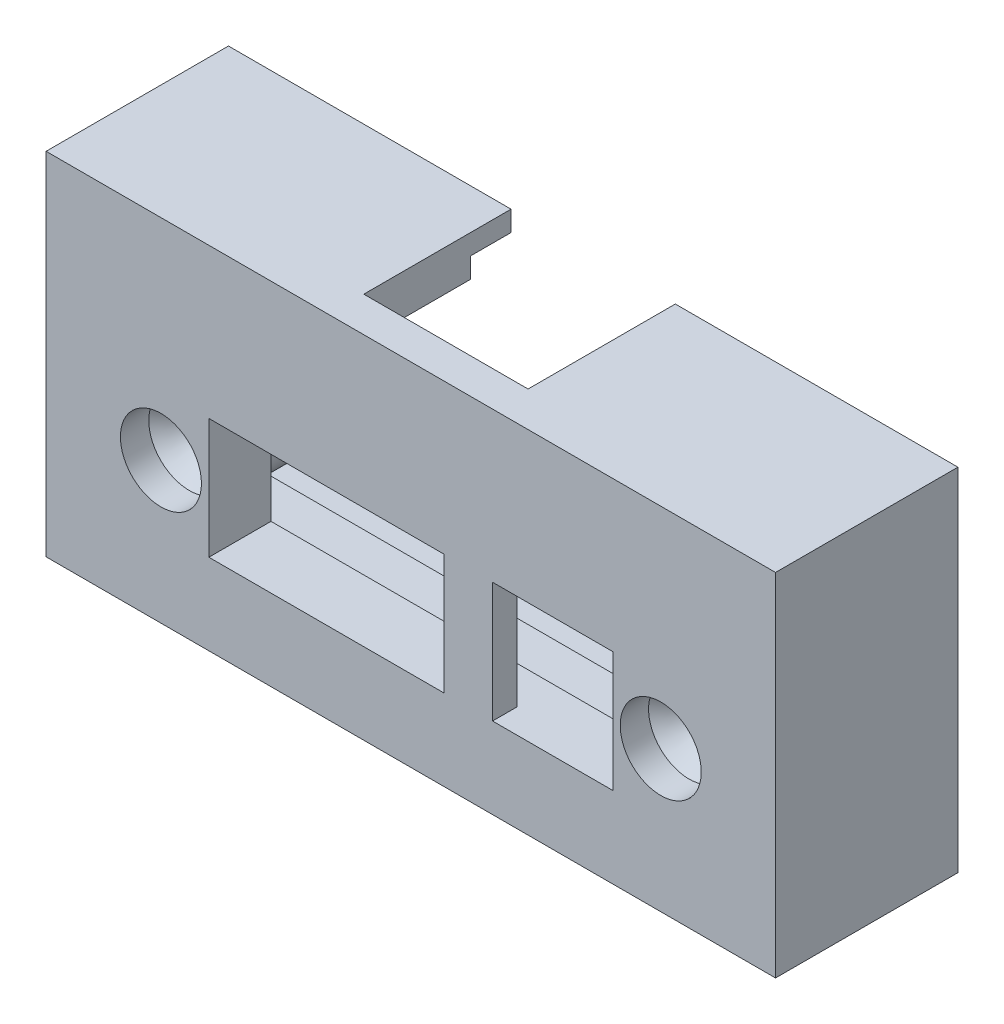
ISO-10303-21;
HEADER;
FILE_DESCRIPTION(('STEP AP214'),'2;1');
FILE_NAME('part.step','',(''),(''),'','','');
FILE_SCHEMA(('AUTOMOTIVE_DESIGN { 1 0 10303 214 1 1 1 1 }'));
ENDSEC;
DATA;
#1=APPLICATION_CONTEXT('core data for automotive mechanical design processes');
#2=APPLICATION_PROTOCOL_DEFINITION('international standard','automotive_design',2000,#1);
#3=PRODUCT_CONTEXT('',#1,'mechanical');
#4=PRODUCT('Part','Part','',(#3));
#5=PRODUCT_RELATED_PRODUCT_CATEGORY('part','',(#4));
#6=PRODUCT_DEFINITION_FORMATION('','',#4);
#7=PRODUCT_DEFINITION_CONTEXT('part definition',#1,'design');
#8=PRODUCT_DEFINITION('design','',#6,#7);
#9=PRODUCT_DEFINITION_SHAPE('','',#8);
#10=(LENGTH_UNIT() NAMED_UNIT(*) SI_UNIT(.MILLI.,.METRE.));
#11=(NAMED_UNIT(*) PLANE_ANGLE_UNIT() SI_UNIT($,.RADIAN.));
#12=(NAMED_UNIT(*) SI_UNIT($,.STERADIAN.) SOLID_ANGLE_UNIT());
#13=UNCERTAINTY_MEASURE_WITH_UNIT(LENGTH_MEASURE(1.E-05),#10,'distance_accuracy_value','');
#14=(GEOMETRIC_REPRESENTATION_CONTEXT(3) GLOBAL_UNCERTAINTY_ASSIGNED_CONTEXT((#13)) GLOBAL_UNIT_ASSIGNED_CONTEXT((#10,
#11,#12)) REPRESENTATION_CONTEXT('',''));
#15=CARTESIAN_POINT('',(0.,0.,0.));
#16=DIRECTION('',(0.,0.,1.));
#17=DIRECTION('',(1.,0.,0.));
#18=AXIS2_PLACEMENT_3D('',#15,#16,#17);
#19=CARTESIAN_POINT('',(-18.5,-5.49999999999999,9.12548339959391));
#20=DIRECTION('',(0.,0.,-1.));
#21=DIRECTION('',(0.,1.,0.));
#22=AXIS2_PLACEMENT_3D('',#19,#20,#21);
#23=CYLINDRICAL_SURFACE('',#22,1.6);
#24=CARTESIAN_POINT('',(-18.5,-5.49999999999999,1.09999999999999));
#25=DIRECTION('',(0.,0.,1.));
#26=DIRECTION('',(1.,0.,0.));
#27=AXIS2_PLACEMENT_3D('',#24,#25,#26);
#28=CIRCLE('',#27,1.6);
#29=CARTESIAN_POINT('',(-16.9,-5.49999999999999,1.09999999999999));
#30=VERTEX_POINT('',#29);
#31=EDGE_CURVE('E444',#30,#30,#28,.T.);
#32=ORIENTED_EDGE('',*,*,#31,.T.);
#33=EDGE_LOOP('',(#32));
#34=FACE_BOUND('',#33,.T.);
#35=CARTESIAN_POINT('',(-18.5,-5.49999999999999,-7.4));
#36=DIRECTION('',(0.,0.,-1.));
#37=DIRECTION('',(0.,1.,0.));
#38=AXIS2_PLACEMENT_3D('',#35,#36,#37);
#39=CIRCLE('',#38,1.6);
#40=CARTESIAN_POINT('',(-18.5,-3.89999999999999,-7.4));
#41=VERTEX_POINT('',#40);
#42=EDGE_CURVE('E264',#41,#41,#39,.T.);
#43=ORIENTED_EDGE('',*,*,#42,.T.);
#44=EDGE_LOOP('',(#43));
#45=FACE_BOUND('',#44,.T.);
#46=ADVANCED_FACE('F35',(#34,#45),#23,.F.);
#47=CARTESIAN_POINT('',(18.5,-5.49999999999997,9.12548339959391));
#48=DIRECTION('',(0.,0.,-1.));
#49=DIRECTION('',(0.,1.,0.));
#50=AXIS2_PLACEMENT_3D('',#47,#48,#49);
#51=CYLINDRICAL_SURFACE('',#50,1.6);
#52=CARTESIAN_POINT('',(18.5,-5.49999999999997,1.09999999999999));
#53=DIRECTION('',(0.,0.,1.));
#54=DIRECTION('',(1.,0.,0.));
#55=AXIS2_PLACEMENT_3D('',#52,#53,#54);
#56=CIRCLE('',#55,1.6);
#57=CARTESIAN_POINT('',(20.1,-5.49999999999997,1.09999999999999));
#58=VERTEX_POINT('',#57);
#59=EDGE_CURVE('E441',#58,#58,#56,.T.);
#60=ORIENTED_EDGE('',*,*,#59,.T.);
#61=EDGE_LOOP('',(#60));
#62=FACE_BOUND('',#61,.T.);
#63=CARTESIAN_POINT('',(18.5,-5.49999999999997,-7.4));
#64=DIRECTION('',(0.,0.,-1.));
#65=DIRECTION('',(0.,1.,0.));
#66=AXIS2_PLACEMENT_3D('',#63,#64,#65);
#67=CIRCLE('',#66,1.6);
#68=CARTESIAN_POINT('',(18.5,-3.89999999999997,-7.4));
#69=VERTEX_POINT('',#68);
#70=EDGE_CURVE('E265',#69,#69,#67,.T.);
#71=ORIENTED_EDGE('',*,*,#70,.T.);
#72=EDGE_LOOP('',(#71));
#73=FACE_BOUND('',#72,.T.);
#74=ADVANCED_FACE('F466',(#62,#73),#51,.F.);
#75=CARTESIAN_POINT('',(-24.,7.05000000000004,-68.8332962550868));
#76=DIRECTION('',(0.,-1.,0.));
#77=DIRECTION('',(1.,0.,0.));
#78=AXIS2_PLACEMENT_3D('',#75,#76,#77);
#79=PLANE('',#78);
#80=DIRECTION('',(0.,0.,1.));
#81=VECTOR('',#80,1.);
#82=CARTESIAN_POINT('',(-6.08,7.05000000000004,2.));
#83=LINE('',#82,#81);
#84=CARTESIAN_POINT('',(-6.08,7.05000000000004,-5.9));
#85=VERTEX_POINT('',#84);
#86=CARTESIAN_POINT('',(-6.08,7.05000000000004,0.));
#87=VERTEX_POINT('',#86);
#88=EDGE_CURVE('E253',#85,#87,#83,.T.);
#89=ORIENTED_EDGE('',*,*,#88,.T.);
#90=DIRECTION('',(1.,0.,0.));
#91=VECTOR('',#90,1.);
#92=CARTESIAN_POINT('',(-24.,7.05000000000004,0.));
#93=LINE('',#92,#91);
#94=CARTESIAN_POINT('',(-24.,7.05000000000004,0.));
#95=VERTEX_POINT('',#94);
#96=EDGE_CURVE('E326',#95,#87,#93,.T.);
#97=ORIENTED_EDGE('',*,*,#96,.F.);
#98=DIRECTION('',(0.,0.,1.));
#99=VECTOR('',#98,1.);
#100=CARTESIAN_POINT('',(-24.,7.05000000000004,-68.8332962550868));
#101=LINE('',#100,#99);
#102=CARTESIAN_POINT('',(-24.,7.05000000000004,-5.9));
#103=VERTEX_POINT('',#102);
#104=EDGE_CURVE('E337',#103,#95,#101,.T.);
#105=ORIENTED_EDGE('',*,*,#104,.F.);
#106=DIRECTION('',(1.,0.,0.));
#107=VECTOR('',#106,1.);
#108=CARTESIAN_POINT('',(-24.,7.05000000000004,-5.9));
#109=LINE('',#108,#107);
#110=EDGE_CURVE('E58',#103,#85,#109,.T.);
#111=ORIENTED_EDGE('',*,*,#110,.T.);
#112=EDGE_LOOP('',(#89,#97,#105,#111));
#113=FACE_BOUND('',#112,.T.);
#114=ADVANCED_FACE('F472',(#113),#79,.T.);
#115=CARTESIAN_POINT('',(-25.5,8.55000000000004,-5.9));
#116=DIRECTION('',(0.,1.,0.));
#117=DIRECTION('',(-1.,0.,0.));
#118=AXIS2_PLACEMENT_3D('',#115,#116,#117);
#119=PLANE('',#118);
#120=DIRECTION('',(1.,0.,0.));
#121=VECTOR('',#120,1.);
#122=CARTESIAN_POINT('',(-25.5,8.55000000000004,-8.9));
#123=LINE('',#122,#121);
#124=CARTESIAN_POINT('',(-25.5,8.55000000000004,-8.9));
#125=VERTEX_POINT('',#124);
#126=CARTESIAN_POINT('',(-6.08,8.55000000000004,-8.89999999999999));
#127=VERTEX_POINT('',#126);
#128=EDGE_CURVE('E298',#125,#127,#123,.T.);
#129=ORIENTED_EDGE('',*,*,#128,.T.);
#130=DIRECTION('',(0.,0.,1.));
#131=VECTOR('',#130,1.);
#132=CARTESIAN_POINT('',(-6.08,8.55000000000004,-5.9));
#133=LINE('',#132,#131);
#134=CARTESIAN_POINT('',(-6.08,8.55000000000004,-5.9));
#135=VERTEX_POINT('',#134);
#136=EDGE_CURVE('E259',#127,#135,#133,.T.);
#137=ORIENTED_EDGE('',*,*,#136,.T.);
#138=DIRECTION('',(1.,0.,0.));
#139=VECTOR('',#138,1.);
#140=CARTESIAN_POINT('',(-25.5,8.55000000000004,-5.9));
#141=LINE('',#140,#139);
#142=CARTESIAN_POINT('',(-25.5,8.55000000000004,-5.9));
#143=VERTEX_POINT('',#142);
#144=EDGE_CURVE('E286',#143,#135,#141,.T.);
#145=ORIENTED_EDGE('',*,*,#144,.F.);
#146=DIRECTION('',(0.,0.,-1.));
#147=VECTOR('',#146,1.);
#148=CARTESIAN_POINT('',(-25.5,8.55000000000004,-5.9));
#149=LINE('',#148,#147);
#150=EDGE_CURVE('E295',#143,#125,#149,.T.);
#151=ORIENTED_EDGE('',*,*,#150,.T.);
#152=EDGE_LOOP('',(#129,#137,#145,#151));
#153=FACE_BOUND('',#152,.T.);
#154=ADVANCED_FACE('F495',(#153),#119,.F.);
#155=DIRECTION('',(0.,0.,-1.));
#156=VECTOR('',#155,1.);
#157=CARTESIAN_POINT('',(6.08,7.05000000000004,2.));
#158=LINE('',#157,#156);
#159=CARTESIAN_POINT('',(6.08,7.05000000000004,0.));
#160=VERTEX_POINT('',#159);
#161=CARTESIAN_POINT('',(6.08,7.05000000000004,-5.9));
#162=VERTEX_POINT('',#161);
#163=EDGE_CURVE('E224',#160,#162,#158,.T.);
#164=ORIENTED_EDGE('',*,*,#163,.T.);
#165=CARTESIAN_POINT('',(24.,7.05000000000003,-5.9));
#166=VERTEX_POINT('',#165);
#167=EDGE_CURVE('E272',#162,#166,#109,.T.);
#168=ORIENTED_EDGE('',*,*,#167,.T.);
#169=DIRECTION('',(0.,0.,1.));
#170=VECTOR('',#169,1.);
#171=CARTESIAN_POINT('',(24.,7.05000000000004,-68.8332962550868));
#172=LINE('',#171,#170);
#173=CARTESIAN_POINT('',(24.,7.05000000000004,0.));
#174=VERTEX_POINT('',#173);
#175=EDGE_CURVE('E329',#166,#174,#172,.T.);
#176=ORIENTED_EDGE('',*,*,#175,.T.);
#177=EDGE_CURVE('E308',#160,#174,#93,.T.);
#178=ORIENTED_EDGE('',*,*,#177,.F.);
#179=EDGE_LOOP('',(#164,#168,#176,#178));
#180=FACE_BOUND('',#179,.T.);
#181=ADVANCED_FACE('F512',(#180),#79,.T.);
#182=CARTESIAN_POINT('',(24.,7.05000000000004,-68.8332962550868));
#183=DIRECTION('',(-1.,0.,0.));
#184=DIRECTION('',(0.,-1.,0.));
#185=AXIS2_PLACEMENT_3D('',#182,#183,#184);
#186=PLANE('',#185);
#187=ORIENTED_EDGE('',*,*,#175,.F.);
#188=DIRECTION('',(0.,-1.,0.));
#189=VECTOR('',#188,1.);
#190=CARTESIAN_POINT('',(24.,7.05000000000003,-5.9));
#191=LINE('',#190,#189);
#192=CARTESIAN_POINT('',(24.,-12.95,-5.9));
#193=VERTEX_POINT('',#192);
#194=EDGE_CURVE('E274',#166,#193,#191,.T.);
#195=ORIENTED_EDGE('',*,*,#194,.T.);
#196=DIRECTION('',(0.,0.,1.));
#197=VECTOR('',#196,1.);
#198=CARTESIAN_POINT('',(24.,-12.95,-68.8332962550868));
#199=LINE('',#198,#197);
#200=CARTESIAN_POINT('',(24.,-12.95,0.));
#201=VERTEX_POINT('',#200);
#202=EDGE_CURVE('E332',#193,#201,#199,.T.);
#203=ORIENTED_EDGE('',*,*,#202,.T.);
#204=DIRECTION('',(0.,-1.,0.));
#205=VECTOR('',#204,1.);
#206=CARTESIAN_POINT('',(24.,7.05000000000004,0.));
#207=LINE('',#206,#205);
#208=EDGE_CURVE('E323',#174,#201,#207,.T.);
#209=ORIENTED_EDGE('',*,*,#208,.F.);
#210=EDGE_LOOP('',(#187,#195,#203,#209));
#211=FACE_BOUND('',#210,.T.);
#212=ADVANCED_FACE('F508',(#211),#186,.T.);
#213=CARTESIAN_POINT('',(24.,-12.95,-68.8332962550868));
#214=DIRECTION('',(0.,1.,0.));
#215=DIRECTION('',(-1.,0.,0.));
#216=AXIS2_PLACEMENT_3D('',#213,#214,#215);
#217=PLANE('',#216);
#218=ORIENTED_EDGE('',*,*,#202,.F.);
#219=DIRECTION('',(-1.,0.,0.));
#220=VECTOR('',#219,1.);
#221=CARTESIAN_POINT('',(24.,-12.95,-5.9));
#222=LINE('',#221,#220);
#223=CARTESIAN_POINT('',(-24.,-12.95,-5.9));
#224=VERTEX_POINT('',#223);
#225=EDGE_CURVE('E277',#193,#224,#222,.T.);
#226=ORIENTED_EDGE('',*,*,#225,.T.);
#227=DIRECTION('',(0.,0.,1.));
#228=VECTOR('',#227,1.);
#229=CARTESIAN_POINT('',(-24.,-12.95,-68.8332962550868));
#230=LINE('',#229,#228);
#231=CARTESIAN_POINT('',(-24.,-12.95,0.));
#232=VERTEX_POINT('',#231);
#233=EDGE_CURVE('E335',#224,#232,#230,.T.);
#234=ORIENTED_EDGE('',*,*,#233,.T.);
#235=DIRECTION('',(-1.,0.,0.));
#236=VECTOR('',#235,1.);
#237=CARTESIAN_POINT('',(24.,-12.95,0.));
#238=LINE('',#237,#236);
#239=EDGE_CURVE('E320',#201,#232,#238,.T.);
#240=ORIENTED_EDGE('',*,*,#239,.F.);
#241=EDGE_LOOP('',(#218,#226,#234,#240));
#242=FACE_BOUND('',#241,.T.);
#243=ADVANCED_FACE('F504',(#242),#217,.T.);
#244=CARTESIAN_POINT('',(-24.,-12.95,-68.8332962550868));
#245=DIRECTION('',(1.,0.,0.));
#246=DIRECTION('',(0.,0.,-1.));
#247=AXIS2_PLACEMENT_3D('',#244,#245,#246);
#248=PLANE('',#247);
#249=ORIENTED_EDGE('',*,*,#233,.F.);
#250=DIRECTION('',(0.,1.,0.));
#251=VECTOR('',#250,1.);
#252=CARTESIAN_POINT('',(-24.,-12.95,-5.9));
#253=LINE('',#252,#251);
#254=EDGE_CURVE('E268',#224,#103,#253,.T.);
#255=ORIENTED_EDGE('',*,*,#254,.T.);
#256=ORIENTED_EDGE('',*,*,#104,.T.);
#257=DIRECTION('',(0.,1.,0.));
#258=VECTOR('',#257,1.);
#259=CARTESIAN_POINT('',(-24.,-12.95,0.));
#260=LINE('',#259,#258);
#261=EDGE_CURVE('E316',#232,#95,#260,.T.);
#262=ORIENTED_EDGE('',*,*,#261,.F.);
#263=EDGE_LOOP('',(#249,#255,#256,#262));
#264=FACE_BOUND('',#263,.T.);
#265=ADVANCED_FACE('F500',(#264),#248,.T.);
#266=CARTESIAN_POINT('',(0.,0.,0.));
#267=DIRECTION('',(0.,0.,-1.));
#268=DIRECTION('',(-1.,0.,0.));
#269=AXIS2_PLACEMENT_3D('',#266,#267,#268);
#270=PLANE('',#269);
#271=ORIENTED_EDGE('',*,*,#96,.T.);
#272=DIRECTION('',(-1.,0.,0.));
#273=VECTOR('',#272,1.);
#274=CARTESIAN_POINT('',(0.,7.05000000000004,0.));
#275=LINE('',#274,#273);
#276=EDGE_CURVE('E262',#160,#87,#275,.T.);
#277=ORIENTED_EDGE('',*,*,#276,.F.);
#278=ORIENTED_EDGE('',*,*,#177,.T.);
#279=ORIENTED_EDGE('',*,*,#208,.T.);
#280=ORIENTED_EDGE('',*,*,#239,.T.);
#281=ORIENTED_EDGE('',*,*,#261,.T.);
#282=EDGE_LOOP('',(#271,#277,#278,#279,#280,#281));
#283=FACE_BOUND('',#282,.T.);
#284=CARTESIAN_POINT('',(-18.5,-5.49999999999999,0.));
#285=DIRECTION('',(0.,0.,-1.));
#286=DIRECTION('',(-1.,0.,0.));
#287=AXIS2_PLACEMENT_3D('',#284,#285,#286);
#288=CIRCLE('',#287,3.45);
#289=CARTESIAN_POINT('',(-21.95,-5.49999999999999,0.));
#290=VERTEX_POINT('',#289);
#291=EDGE_CURVE('E339',#290,#290,#288,.T.);
#292=ORIENTED_EDGE('',*,*,#291,.F.);
#293=EDGE_LOOP('',(#292));
#294=FACE_BOUND('',#293,.T.);
#295=CARTESIAN_POINT('',(18.5,-5.49999999999997,0.));
#296=DIRECTION('',(0.,0.,-1.));
#297=DIRECTION('',(-1.,0.,0.));
#298=AXIS2_PLACEMENT_3D('',#295,#296,#297);
#299=CIRCLE('',#298,3.45);
#300=CARTESIAN_POINT('',(15.05,-5.49999999999997,0.));
#301=VERTEX_POINT('',#300);
#302=EDGE_CURVE('E354',#301,#301,#299,.T.);
#303=ORIENTED_EDGE('',*,*,#302,.F.);
#304=EDGE_LOOP('',(#303));
#305=FACE_BOUND('',#304,.T.);
#306=DIRECTION('',(0.,1.,0.));
#307=VECTOR('',#306,1.);
#308=CARTESIAN_POINT('',(14.95,-9.95,0.));
#309=LINE('',#308,#307);
#310=CARTESIAN_POINT('',(14.95,-9.95,0.));
#311=VERTEX_POINT('',#310);
#312=CARTESIAN_POINT('',(14.95,-1.05,0.));
#313=VERTEX_POINT('',#312);
#314=EDGE_CURVE('E384',#311,#313,#309,.T.);
#315=ORIENTED_EDGE('',*,*,#314,.T.);
#316=DIRECTION('',(-1.,0.,0.));
#317=VECTOR('',#316,1.);
#318=CARTESIAN_POINT('',(14.95,-1.05,0.));
#319=LINE('',#318,#317);
#320=CARTESIAN_POINT('',(-14.95,-1.04999999999999,0.));
#321=VERTEX_POINT('',#320);
#322=EDGE_CURVE('E387',#313,#321,#319,.T.);
#323=ORIENTED_EDGE('',*,*,#322,.T.);
#324=DIRECTION('',(0.,-1.,0.));
#325=VECTOR('',#324,1.);
#326=CARTESIAN_POINT('',(-14.95,-1.04999999999999,0.));
#327=LINE('',#326,#325);
#328=CARTESIAN_POINT('',(-14.95,-9.95,0.));
#329=VERTEX_POINT('',#328);
#330=EDGE_CURVE('E392',#321,#329,#327,.T.);
#331=ORIENTED_EDGE('',*,*,#330,.T.);
#332=DIRECTION('',(1.,0.,0.));
#333=VECTOR('',#332,1.);
#334=CARTESIAN_POINT('',(-14.95,-9.95,0.));
#335=LINE('',#334,#333);
#336=EDGE_CURVE('E388',#329,#311,#335,.T.);
#337=ORIENTED_EDGE('',*,*,#336,.T.);
#338=EDGE_LOOP('',(#315,#323,#331,#337));
#339=FACE_BOUND('',#338,.T.);
#340=ADVANCED_FACE('F503',(#283,#294,#305,#339),#270,.T.);
#341=CARTESIAN_POINT('',(27.,-15.95,64.5332962550868));
#342=DIRECTION('',(-1.,0.,0.));
#343=DIRECTION('',(0.,-1.,0.));
#344=AXIS2_PLACEMENT_3D('',#341,#342,#343);
#345=PLANE('',#344);
#346=DIRECTION('',(0.,0.,-1.));
#347=VECTOR('',#346,1.);
#348=CARTESIAN_POINT('',(27.,10.05,64.5332962550868));
#349=LINE('',#348,#347);
#350=CARTESIAN_POINT('',(27.,10.05,4.60000000000001));
#351=VERTEX_POINT('',#350);
#352=CARTESIAN_POINT('',(27.,10.05,-8.89999999999999));
#353=VERTEX_POINT('',#352);
#354=EDGE_CURVE('E401',#351,#353,#349,.T.);
#355=ORIENTED_EDGE('',*,*,#354,.F.);
#356=DIRECTION('',(0.,-1.,0.));
#357=VECTOR('',#356,1.);
#358=CARTESIAN_POINT('',(27.,-15.95,4.60000000000001));
#359=LINE('',#358,#357);
#360=CARTESIAN_POINT('',(27.,-15.95,4.60000000000001));
#361=VERTEX_POINT('',#360);
#362=EDGE_CURVE('E391',#351,#361,#359,.T.);
#363=ORIENTED_EDGE('',*,*,#362,.T.);
#364=DIRECTION('',(0.,0.,-1.));
#365=VECTOR('',#364,1.);
#366=CARTESIAN_POINT('',(27.,-15.95,64.5332962550868));
#367=LINE('',#366,#365);
#368=CARTESIAN_POINT('',(27.,-15.95,-8.89999999999999));
#369=VERTEX_POINT('',#368);
#370=EDGE_CURVE('E412',#361,#369,#367,.T.);
#371=ORIENTED_EDGE('',*,*,#370,.T.);
#372=DIRECTION('',(0.,1.,0.));
#373=VECTOR('',#372,1.);
#374=CARTESIAN_POINT('',(27.,10.05,-8.89999999999999));
#375=LINE('',#374,#373);
#376=EDGE_CURVE('E341',#369,#353,#375,.T.);
#377=ORIENTED_EDGE('',*,*,#376,.T.);
#378=EDGE_LOOP('',(#355,#363,#371,#377));
#379=FACE_BOUND('',#378,.T.);
#380=ADVANCED_FACE('F551',(#379),#345,.F.);
#381=CARTESIAN_POINT('',(-27.,10.05,64.5332962550868));
#382=DIRECTION('',(0.,-1.,0.));
#383=DIRECTION('',(0.,0.,-1.));
#384=AXIS2_PLACEMENT_3D('',#381,#382,#383);
#385=PLANE('',#384);
#386=DIRECTION('',(1.,0.,0.));
#387=VECTOR('',#386,1.);
#388=CARTESIAN_POINT('',(6.08,10.05,2.));
#389=LINE('',#388,#387);
#390=CARTESIAN_POINT('',(-6.08,10.05,2.));
#391=VERTEX_POINT('',#390);
#392=CARTESIAN_POINT('',(6.08,10.05,2.));
#393=VERTEX_POINT('',#392);
#394=EDGE_CURVE('E228',#391,#393,#389,.T.);
#395=ORIENTED_EDGE('',*,*,#394,.F.);
#396=DIRECTION('',(0.,0.,1.));
#397=VECTOR('',#396,1.);
#398=CARTESIAN_POINT('',(-6.08,10.05,2.));
#399=LINE('',#398,#397);
#400=CARTESIAN_POINT('',(-6.08,10.05,-8.89999999999999));
#401=VERTEX_POINT('',#400);
#402=EDGE_CURVE('E236',#401,#391,#399,.T.);
#403=ORIENTED_EDGE('',*,*,#402,.F.);
#404=DIRECTION('',(-1.,0.,0.));
#405=VECTOR('',#404,1.);
#406=CARTESIAN_POINT('',(-27.,10.05,-8.89999999999999));
#407=LINE('',#406,#405);
#408=CARTESIAN_POINT('',(-27.,10.05,-8.9));
#409=VERTEX_POINT('',#408);
#410=EDGE_CURVE('E319',#401,#409,#407,.T.);
#411=ORIENTED_EDGE('',*,*,#410,.T.);
#412=DIRECTION('',(0.,0.,-1.));
#413=VECTOR('',#412,1.);
#414=CARTESIAN_POINT('',(-27.,10.05,64.5332962550868));
#415=LINE('',#414,#413);
#416=CARTESIAN_POINT('',(-27.,10.05,4.6));
#417=VERTEX_POINT('',#416);
#418=EDGE_CURVE('E405',#417,#409,#415,.T.);
#419=ORIENTED_EDGE('',*,*,#418,.F.);
#420=DIRECTION('',(1.,0.,0.));
#421=VECTOR('',#420,1.);
#422=CARTESIAN_POINT('',(-27.,10.05,4.60000000000001));
#423=LINE('',#422,#421);
#424=EDGE_CURVE('E404',#417,#351,#423,.T.);
#425=ORIENTED_EDGE('',*,*,#424,.T.);
#426=ORIENTED_EDGE('',*,*,#354,.T.);
#427=CARTESIAN_POINT('',(6.08,10.05,-8.89999999999999));
#428=VERTEX_POINT('',#427);
#429=EDGE_CURVE('E241',#353,#428,#407,.T.);
#430=ORIENTED_EDGE('',*,*,#429,.T.);
#431=DIRECTION('',(0.,0.,-1.));
#432=VECTOR('',#431,1.);
#433=CARTESIAN_POINT('',(6.08,10.05,2.));
#434=LINE('',#433,#432);
#435=EDGE_CURVE('E217',#393,#428,#434,.T.);
#436=ORIENTED_EDGE('',*,*,#435,.F.);
#437=EDGE_LOOP('',(#395,#403,#411,#419,#425,#426,#430,#436));
#438=FACE_BOUND('',#437,.T.);
#439=ADVANCED_FACE('F239',(#438),#385,.F.);
#440=CARTESIAN_POINT('',(-27.,-15.95,64.5332962550868));
#441=DIRECTION('',(1.,0.,0.));
#442=DIRECTION('',(0.,0.,-1.));
#443=AXIS2_PLACEMENT_3D('',#440,#441,#442);
#444=PLANE('',#443);
#445=DIRECTION('',(0.,0.,-1.));
#446=VECTOR('',#445,1.);
#447=CARTESIAN_POINT('',(-27.,-15.95,64.5332962550868));
#448=LINE('',#447,#446);
#449=CARTESIAN_POINT('',(-27.,-15.95,4.60000000000001));
#450=VERTEX_POINT('',#449);
#451=CARTESIAN_POINT('',(-27.,-15.95,-8.89999999999999));
#452=VERTEX_POINT('',#451);
#453=EDGE_CURVE('E409',#450,#452,#448,.T.);
#454=ORIENTED_EDGE('',*,*,#453,.F.);
#455=DIRECTION('',(0.,1.,0.));
#456=VECTOR('',#455,1.);
#457=CARTESIAN_POINT('',(-27.,-15.95,4.60000000000001));
#458=LINE('',#457,#456);
#459=EDGE_CURVE('E403',#450,#417,#458,.T.);
#460=ORIENTED_EDGE('',*,*,#459,.T.);
#461=ORIENTED_EDGE('',*,*,#418,.T.);
#462=DIRECTION('',(0.,-1.,0.));
#463=VECTOR('',#462,1.);
#464=CARTESIAN_POINT('',(-27.,-15.95,-8.89999999999999));
#465=LINE('',#464,#463);
#466=EDGE_CURVE('E333',#409,#452,#465,.T.);
#467=ORIENTED_EDGE('',*,*,#466,.T.);
#468=EDGE_LOOP('',(#454,#460,#461,#467));
#469=FACE_BOUND('',#468,.T.);
#470=ADVANCED_FACE('F557',(#469),#444,.F.);
#471=CARTESIAN_POINT('',(-27.,-15.95,64.5332962550868));
#472=DIRECTION('',(0.,1.,0.));
#473=DIRECTION('',(0.,0.,1.));
#474=AXIS2_PLACEMENT_3D('',#471,#472,#473);
#475=PLANE('',#474);
#476=ORIENTED_EDGE('',*,*,#370,.F.);
#477=DIRECTION('',(-1.,0.,0.));
#478=VECTOR('',#477,1.);
#479=CARTESIAN_POINT('',(-27.,-15.95,4.60000000000001));
#480=LINE('',#479,#478);
#481=EDGE_CURVE('E408',#361,#450,#480,.T.);
#482=ORIENTED_EDGE('',*,*,#481,.T.);
#483=ORIENTED_EDGE('',*,*,#453,.T.);
#484=DIRECTION('',(1.,0.,0.));
#485=VECTOR('',#484,1.);
#486=CARTESIAN_POINT('',(27.,-15.95,-8.89999999999999));
#487=LINE('',#486,#485);
#488=EDGE_CURVE('E344',#452,#369,#487,.T.);
#489=ORIENTED_EDGE('',*,*,#488,.T.);
#490=EDGE_LOOP('',(#476,#482,#483,#489));
#491=FACE_BOUND('',#490,.T.);
#492=ADVANCED_FACE('F553',(#491),#475,.F.);
#493=CARTESIAN_POINT('',(14.95,-1.05,64.5332962550868));
#494=DIRECTION('',(0.,-1.,0.));
#495=DIRECTION('',(1.,0.,0.));
#496=AXIS2_PLACEMENT_3D('',#493,#494,#495);
#497=PLANE('',#496);
#498=DIRECTION('',(0.,0.,1.));
#499=VECTOR('',#498,1.);
#500=CARTESIAN_POINT('',(6.04999999999999,-1.04999999999999,-7.00052081920559));
#501=LINE('',#500,#499);
#502=CARTESIAN_POINT('',(6.04999999999999,-1.04999999999999,2.8));
#503=VERTEX_POINT('',#502);
#504=CARTESIAN_POINT('',(6.04999999999999,-1.05,4.60000000000001));
#505=VERTEX_POINT('',#504);
#506=EDGE_CURVE('E372',#503,#505,#501,.T.);
#507=ORIENTED_EDGE('',*,*,#506,.F.);
#508=DIRECTION('',(1.,0.,0.));
#509=VECTOR('',#508,1.);
#510=CARTESIAN_POINT('',(6.04999999999999,-1.04999999999999,2.8));
#511=LINE('',#510,#509);
#512=CARTESIAN_POINT('',(2.44999999999998,-1.04999999999999,2.8));
#513=VERTEX_POINT('',#512);
#514=EDGE_CURVE('E368',#513,#503,#511,.T.);
#515=ORIENTED_EDGE('',*,*,#514,.F.);
#516=DIRECTION('',(0.,0.,1.));
#517=VECTOR('',#516,1.);
#518=CARTESIAN_POINT('',(2.44999999999998,-1.04999999999999,-7.00052081920559));
#519=LINE('',#518,#517);
#520=CARTESIAN_POINT('',(2.44999999999998,-1.04999999999999,4.6));
#521=VERTEX_POINT('',#520);
#522=EDGE_CURVE('E378',#513,#521,#519,.T.);
#523=ORIENTED_EDGE('',*,*,#522,.T.);
#524=DIRECTION('',(1.,0.,0.));
#525=VECTOR('',#524,1.);
#526=CARTESIAN_POINT('',(14.95,-1.05,4.60000000000001));
#527=LINE('',#526,#525);
#528=CARTESIAN_POINT('',(-14.95,-1.04999999999999,4.60000000000001));
#529=VERTEX_POINT('',#528);
#530=EDGE_CURVE('E400',#529,#521,#527,.T.);
#531=ORIENTED_EDGE('',*,*,#530,.F.);
#532=DIRECTION('',(0.,0.,-1.));
#533=VECTOR('',#532,1.);
#534=CARTESIAN_POINT('',(-14.95,-1.04999999999999,64.5332962550868));
#535=LINE('',#534,#533);
#536=EDGE_CURVE('E411',#529,#321,#535,.T.);
#537=ORIENTED_EDGE('',*,*,#536,.T.);
#538=ORIENTED_EDGE('',*,*,#322,.F.);
#539=DIRECTION('',(0.,0.,-1.));
#540=VECTOR('',#539,1.);
#541=CARTESIAN_POINT('',(14.95,-1.05,64.5332962550868));
#542=LINE('',#541,#540);
#543=CARTESIAN_POINT('',(14.95,-1.05,4.60000000000001));
#544=VERTEX_POINT('',#543);
#545=EDGE_CURVE('E419',#544,#313,#542,.T.);
#546=ORIENTED_EDGE('',*,*,#545,.F.);
#547=EDGE_CURVE('E421',#505,#544,#527,.T.);
#548=ORIENTED_EDGE('',*,*,#547,.F.);
#549=EDGE_LOOP('',(#507,#515,#523,#531,#537,#538,#546,#548));
#550=FACE_BOUND('',#549,.T.);
#551=ADVANCED_FACE('F556',(#550),#497,.T.);
#552=CARTESIAN_POINT('',(-14.95,-1.04999999999999,64.5332962550868));
#553=DIRECTION('',(1.,0.,0.));
#554=DIRECTION('',(0.,0.,-1.));
#555=AXIS2_PLACEMENT_3D('',#552,#553,#554);
#556=PLANE('',#555);
#557=DIRECTION('',(0.,1.,0.));
#558=VECTOR('',#557,1.);
#559=CARTESIAN_POINT('',(-14.95,-1.05,4.60000000000001));
#560=LINE('',#559,#558);
#561=CARTESIAN_POINT('',(-14.95,-9.95,4.60000000000001));
#562=VERTEX_POINT('',#561);
#563=EDGE_CURVE('E432',#562,#529,#560,.T.);
#564=ORIENTED_EDGE('',*,*,#563,.F.);
#565=DIRECTION('',(0.,0.,-1.));
#566=VECTOR('',#565,1.);
#567=CARTESIAN_POINT('',(-14.95,-9.95,64.5332962550868));
#568=LINE('',#567,#566);
#569=EDGE_CURVE('E415',#562,#329,#568,.T.);
#570=ORIENTED_EDGE('',*,*,#569,.T.);
#571=ORIENTED_EDGE('',*,*,#330,.F.);
#572=ORIENTED_EDGE('',*,*,#536,.F.);
#573=EDGE_LOOP('',(#564,#570,#571,#572));
#574=FACE_BOUND('',#573,.T.);
#575=ADVANCED_FACE('F574',(#574),#556,.T.);
#576=CARTESIAN_POINT('',(-14.95,-9.95,64.5332962550868));
#577=DIRECTION('',(0.,1.,0.));
#578=DIRECTION('',(-1.,0.,0.));
#579=AXIS2_PLACEMENT_3D('',#576,#577,#578);
#580=PLANE('',#579);
#581=DIRECTION('',(0.,0.,1.));
#582=VECTOR('',#581,1.);
#583=CARTESIAN_POINT('',(6.04999999999999,-9.95,-7.00052081920559));
#584=LINE('',#583,#582);
#585=CARTESIAN_POINT('',(6.04999999999999,-9.95,2.8));
#586=VERTEX_POINT('',#585);
#587=CARTESIAN_POINT('',(6.04999999999999,-9.95,4.6));
#588=VERTEX_POINT('',#587);
#589=EDGE_CURVE('E364',#586,#588,#584,.T.);
#590=ORIENTED_EDGE('',*,*,#589,.T.);
#591=DIRECTION('',(-1.,0.,0.));
#592=VECTOR('',#591,1.);
#593=CARTESIAN_POINT('',(-14.95,-9.95,4.60000000000001));
#594=LINE('',#593,#592);
#595=CARTESIAN_POINT('',(14.95,-9.95,4.60000000000001));
#596=VERTEX_POINT('',#595);
#597=EDGE_CURVE('E435',#596,#588,#594,.T.);
#598=ORIENTED_EDGE('',*,*,#597,.F.);
#599=DIRECTION('',(0.,0.,-1.));
#600=VECTOR('',#599,1.);
#601=CARTESIAN_POINT('',(14.95,-9.95,64.5332962550868));
#602=LINE('',#601,#600);
#603=EDGE_CURVE('E417',#596,#311,#602,.T.);
#604=ORIENTED_EDGE('',*,*,#603,.T.);
#605=ORIENTED_EDGE('',*,*,#336,.F.);
#606=ORIENTED_EDGE('',*,*,#569,.F.);
#607=CARTESIAN_POINT('',(2.44999999999998,-9.95,4.60000000000001));
#608=VERTEX_POINT('',#607);
#609=EDGE_CURVE('E399',#608,#562,#594,.T.);
#610=ORIENTED_EDGE('',*,*,#609,.F.);
#611=DIRECTION('',(0.,0.,1.));
#612=VECTOR('',#611,1.);
#613=CARTESIAN_POINT('',(2.44999999999999,-9.95,-7.00052081920559));
#614=LINE('',#613,#612);
#615=CARTESIAN_POINT('',(2.44999999999999,-9.95,2.8));
#616=VERTEX_POINT('',#615);
#617=EDGE_CURVE('E375',#616,#608,#614,.T.);
#618=ORIENTED_EDGE('',*,*,#617,.F.);
#619=DIRECTION('',(-1.,0.,0.));
#620=VECTOR('',#619,1.);
#621=CARTESIAN_POINT('',(6.04999999999999,-9.95,2.8));
#622=LINE('',#621,#620);
#623=EDGE_CURVE('E363',#586,#616,#622,.T.);
#624=ORIENTED_EDGE('',*,*,#623,.F.);
#625=EDGE_LOOP('',(#590,#598,#604,#605,#606,#610,#618,#624));
#626=FACE_BOUND('',#625,.T.);
#627=ADVANCED_FACE('F570',(#626),#580,.T.);
#628=CARTESIAN_POINT('',(14.95,-9.95,64.5332962550868));
#629=DIRECTION('',(-1.,0.,0.));
#630=DIRECTION('',(0.,0.,1.));
#631=AXIS2_PLACEMENT_3D('',#628,#629,#630);
#632=PLANE('',#631);
#633=DIRECTION('',(0.,-1.,0.));
#634=VECTOR('',#633,1.);
#635=CARTESIAN_POINT('',(14.95,-9.95,4.60000000000001));
#636=LINE('',#635,#634);
#637=EDGE_CURVE('E397',#544,#596,#636,.T.);
#638=ORIENTED_EDGE('',*,*,#637,.F.);
#639=ORIENTED_EDGE('',*,*,#545,.T.);
#640=ORIENTED_EDGE('',*,*,#314,.F.);
#641=ORIENTED_EDGE('',*,*,#603,.F.);
#642=EDGE_LOOP('',(#638,#639,#640,#641));
#643=FACE_BOUND('',#642,.T.);
#644=ADVANCED_FACE('F567',(#643),#632,.T.);
#645=CARTESIAN_POINT('',(2.24999999999998,-8.75,4.6));
#646=DIRECTION('',(0.,0.,-1.));
#647=DIRECTION('',(-1.,0.,0.));
#648=AXIS2_PLACEMENT_3D('',#645,#646,#647);
#649=PLANE('',#648);
#650=CARTESIAN_POINT('',(-18.5,-5.49999999999999,4.60000000000001));
#651=DIRECTION('',(0.,0.,1.));
#652=DIRECTION('',(1.,0.,0.));
#653=AXIS2_PLACEMENT_3D('',#650,#651,#652);
#654=CIRCLE('',#653,3.);
#655=CARTESIAN_POINT('',(-15.5,-5.49999999999999,4.60000000000001));
#656=VERTEX_POINT('',#655);
#657=EDGE_CURVE('E242',#656,#656,#654,.T.);
#658=ORIENTED_EDGE('',*,*,#657,.F.);
#659=EDGE_LOOP('',(#658));
#660=FACE_BOUND('',#659,.T.);
#661=CARTESIAN_POINT('',(18.5,-5.49999999999997,4.60000000000001));
#662=DIRECTION('',(0.,0.,1.));
#663=DIRECTION('',(1.,0.,0.));
#664=AXIS2_PLACEMENT_3D('',#661,#662,#663);
#665=CIRCLE('',#664,3.);
#666=CARTESIAN_POINT('',(21.5,-5.49999999999997,4.60000000000001));
#667=VERTEX_POINT('',#666);
#668=EDGE_CURVE('E246',#667,#667,#665,.T.);
#669=ORIENTED_EDGE('',*,*,#668,.F.);
#670=EDGE_LOOP('',(#669));
#671=FACE_BOUND('',#670,.T.);
#672=ORIENTED_EDGE('',*,*,#597,.T.);
#673=DIRECTION('',(0.,1.,0.));
#674=VECTOR('',#673,1.);
#675=CARTESIAN_POINT('',(6.04999999999999,-1.04999999999999,4.6));
#676=LINE('',#675,#674);
#677=EDGE_CURVE('E360',#588,#505,#676,.T.);
#678=ORIENTED_EDGE('',*,*,#677,.T.);
#679=ORIENTED_EDGE('',*,*,#547,.T.);
#680=ORIENTED_EDGE('',*,*,#637,.T.);
#681=EDGE_LOOP('',(#672,#678,#679,#680));
#682=FACE_BOUND('',#681,.T.);
#683=ORIENTED_EDGE('',*,*,#530,.T.);
#684=DIRECTION('',(0.,-1.,0.));
#685=VECTOR('',#684,1.);
#686=CARTESIAN_POINT('',(2.44999999999998,-1.04999999999999,4.6));
#687=LINE('',#686,#685);
#688=EDGE_CURVE('E370',#521,#608,#687,.T.);
#689=ORIENTED_EDGE('',*,*,#688,.T.);
#690=ORIENTED_EDGE('',*,*,#609,.T.);
#691=ORIENTED_EDGE('',*,*,#563,.T.);
#692=EDGE_LOOP('',(#683,#689,#690,#691));
#693=FACE_BOUND('',#692,.T.);
#694=ORIENTED_EDGE('',*,*,#424,.F.);
#695=ORIENTED_EDGE('',*,*,#459,.F.);
#696=ORIENTED_EDGE('',*,*,#481,.F.);
#697=ORIENTED_EDGE('',*,*,#362,.F.);
#698=EDGE_LOOP('',(#694,#695,#696,#697));
#699=FACE_BOUND('',#698,.T.);
#700=ADVANCED_FACE('F547',(#660,#671,#682,#693,#699),#649,.F.);
#701=CARTESIAN_POINT('',(6.04999999999999,-1.04999999999999,-7.00052081920559));
#702=DIRECTION('',(1.,0.,0.));
#703=DIRECTION('',(0.,1.,0.));
#704=AXIS2_PLACEMENT_3D('',#701,#702,#703);
#705=PLANE('',#704);
#706=DIRECTION('',(0.,-1.,0.));
#707=VECTOR('',#706,1.);
#708=CARTESIAN_POINT('',(6.04999999999999,-1.04999999999999,2.8));
#709=LINE('',#708,#707);
#710=EDGE_CURVE('E366',#503,#586,#709,.T.);
#711=ORIENTED_EDGE('',*,*,#710,.F.);
#712=ORIENTED_EDGE('',*,*,#506,.T.);
#713=ORIENTED_EDGE('',*,*,#677,.F.);
#714=ORIENTED_EDGE('',*,*,#589,.F.);
#715=EDGE_LOOP('',(#711,#712,#713,#714));
#716=FACE_BOUND('',#715,.T.);
#717=ADVANCED_FACE('F543',(#716),#705,.T.);
#718=CARTESIAN_POINT('',(2.44999999999998,-1.04999999999999,-7.00052081920559));
#719=DIRECTION('',(-1.,0.,0.));
#720=DIRECTION('',(0.,-1.,0.));
#721=AXIS2_PLACEMENT_3D('',#718,#719,#720);
#722=PLANE('',#721);
#723=DIRECTION('',(0.,1.,0.));
#724=VECTOR('',#723,1.);
#725=CARTESIAN_POINT('',(2.44999999999998,-1.04999999999999,2.8));
#726=LINE('',#725,#724);
#727=EDGE_CURVE('E361',#616,#513,#726,.T.);
#728=ORIENTED_EDGE('',*,*,#727,.F.);
#729=ORIENTED_EDGE('',*,*,#617,.T.);
#730=ORIENTED_EDGE('',*,*,#688,.F.);
#731=ORIENTED_EDGE('',*,*,#522,.F.);
#732=EDGE_LOOP('',(#728,#729,#730,#731));
#733=FACE_BOUND('',#732,.T.);
#734=ADVANCED_FACE('F539',(#733),#722,.T.);
#735=CARTESIAN_POINT('',(-14.75,-9.74999999999999,2.80000000000001));
#736=DIRECTION('',(0.,0.,1.));
#737=DIRECTION('',(1.,0.,0.));
#738=AXIS2_PLACEMENT_3D('',#735,#736,#737);
#739=PLANE('',#738);
#740=ORIENTED_EDGE('',*,*,#710,.T.);
#741=ORIENTED_EDGE('',*,*,#623,.T.);
#742=ORIENTED_EDGE('',*,*,#727,.T.);
#743=ORIENTED_EDGE('',*,*,#514,.T.);
#744=EDGE_LOOP('',(#740,#741,#742,#743));
#745=FACE_BOUND('',#744,.T.);
#746=ADVANCED_FACE('F535',(#745),#739,.F.);
#747=CARTESIAN_POINT('',(18.5,-5.49999999999997,-17.1580735803744));
#748=DIRECTION('',(0.,0.,1.));
#749=DIRECTION('',(1.,0.,0.));
#750=AXIS2_PLACEMENT_3D('',#747,#748,#749);
#751=CYLINDRICAL_SURFACE('',#750,3.45);
#752=CARTESIAN_POINT('',(18.5,-5.49999999999997,-7.4));
#753=DIRECTION('',(0.,0.,1.));
#754=DIRECTION('',(0.,-1.,0.));
#755=AXIS2_PLACEMENT_3D('',#752,#753,#754);
#756=CIRCLE('',#755,3.45);
#757=CARTESIAN_POINT('',(18.5,-8.94999999999997,-7.4));
#758=VERTEX_POINT('',#757);
#759=EDGE_CURVE('E357',#758,#758,#756,.T.);
#760=ORIENTED_EDGE('',*,*,#759,.T.);
#761=EDGE_LOOP('',(#760));
#762=FACE_BOUND('',#761,.T.);
#763=ORIENTED_EDGE('',*,*,#302,.T.);
#764=EDGE_LOOP('',(#763));
#765=FACE_BOUND('',#764,.T.);
#766=ADVANCED_FACE('F531',(#762,#765),#751,.T.);
#767=CARTESIAN_POINT('',(18.5,-5.49999999999997,-7.4));
#768=DIRECTION('',(0.,0.,1.));
#769=DIRECTION('',(1.,0.,0.));
#770=AXIS2_PLACEMENT_3D('',#767,#768,#769);
#771=PLANE('',#770);
#772=ORIENTED_EDGE('',*,*,#70,.F.);
#773=EDGE_LOOP('',(#772));
#774=FACE_BOUND('',#773,.T.);
#775=ORIENTED_EDGE('',*,*,#759,.F.);
#776=EDGE_LOOP('',(#775));
#777=FACE_BOUND('',#776,.T.);
#778=ADVANCED_FACE('F527',(#774,#777),#771,.F.);
#779=CARTESIAN_POINT('',(-18.5,-5.49999999999999,-17.1580735803744));
#780=DIRECTION('',(0.,0.,1.));
#781=DIRECTION('',(1.,0.,0.));
#782=AXIS2_PLACEMENT_3D('',#779,#780,#781);
#783=CYLINDRICAL_SURFACE('',#782,3.45);
#784=CARTESIAN_POINT('',(-18.5,-5.49999999999999,-7.4));
#785=DIRECTION('',(0.,0.,1.));
#786=DIRECTION('',(0.,-1.,0.));
#787=AXIS2_PLACEMENT_3D('',#784,#785,#786);
#788=CIRCLE('',#787,3.45);
#789=CARTESIAN_POINT('',(-18.5,-8.94999999999999,-7.4));
#790=VERTEX_POINT('',#789);
#791=EDGE_CURVE('E351',#790,#790,#788,.T.);
#792=ORIENTED_EDGE('',*,*,#791,.T.);
#793=EDGE_LOOP('',(#792));
#794=FACE_BOUND('',#793,.T.);
#795=ORIENTED_EDGE('',*,*,#291,.T.);
#796=EDGE_LOOP('',(#795));
#797=FACE_BOUND('',#796,.T.);
#798=ADVANCED_FACE('F523',(#794,#797),#783,.T.);
#799=CARTESIAN_POINT('',(18.5,-5.49999999999997,-7.4));
#800=DIRECTION('',(0.,0.,1.));
#801=DIRECTION('',(1.,0.,0.));
#802=AXIS2_PLACEMENT_3D('',#799,#800,#801);
#803=PLANE('',#802);
#804=ORIENTED_EDGE('',*,*,#42,.F.);
#805=EDGE_LOOP('',(#804));
#806=FACE_BOUND('',#805,.T.);
#807=ORIENTED_EDGE('',*,*,#791,.F.);
#808=EDGE_LOOP('',(#807));
#809=FACE_BOUND('',#808,.T.);
#810=ADVANCED_FACE('F519',(#806,#809),#803,.F.);
#811=CARTESIAN_POINT('',(-14.75,-12.,-8.9));
#812=DIRECTION('',(0.,0.,1.));
#813=DIRECTION('',(1.,0.,0.));
#814=AXIS2_PLACEMENT_3D('',#811,#812,#813);
#815=PLANE('',#814);
#816=ORIENTED_EDGE('',*,*,#410,.F.);
#817=DIRECTION('',(0.,1.,0.));
#818=VECTOR('',#817,1.);
#819=CARTESIAN_POINT('',(-6.08,-9.28020514261834,-8.89999999999999));
#820=LINE('',#819,#818);
#821=EDGE_CURVE('E235',#127,#401,#820,.T.);
#822=ORIENTED_EDGE('',*,*,#821,.F.);
#823=ORIENTED_EDGE('',*,*,#128,.F.);
#824=DIRECTION('',(0.,1.,0.));
#825=VECTOR('',#824,1.);
#826=CARTESIAN_POINT('',(-25.5,-14.45,-8.9));
#827=LINE('',#826,#825);
#828=CARTESIAN_POINT('',(-25.5,-14.45,-8.9));
#829=VERTEX_POINT('',#828);
#830=EDGE_CURVE('E280',#829,#125,#827,.T.);
#831=ORIENTED_EDGE('',*,*,#830,.F.);
#832=DIRECTION('',(-1.,0.,0.));
#833=VECTOR('',#832,1.);
#834=CARTESIAN_POINT('',(25.5,-14.45,-8.9));
#835=LINE('',#834,#833);
#836=CARTESIAN_POINT('',(25.5,-14.45,-8.9));
#837=VERTEX_POINT('',#836);
#838=EDGE_CURVE('E285',#837,#829,#835,.T.);
#839=ORIENTED_EDGE('',*,*,#838,.F.);
#840=DIRECTION('',(0.,-1.,0.));
#841=VECTOR('',#840,1.);
#842=CARTESIAN_POINT('',(25.5,8.55000000000003,-8.9));
#843=LINE('',#842,#841);
#844=CARTESIAN_POINT('',(25.5,8.55000000000003,-8.9));
#845=VERTEX_POINT('',#844);
#846=EDGE_CURVE('E301',#845,#837,#843,.T.);
#847=ORIENTED_EDGE('',*,*,#846,.F.);
#848=CARTESIAN_POINT('',(6.08,8.55000000000004,-8.89999999999999));
#849=VERTEX_POINT('',#848);
#850=EDGE_CURVE('E297',#849,#845,#123,.T.);
#851=ORIENTED_EDGE('',*,*,#850,.F.);
#852=DIRECTION('',(0.,1.,0.));
#853=VECTOR('',#852,1.);
#854=CARTESIAN_POINT('',(6.08,-9.28020514261834,-8.89999999999999));
#855=LINE('',#854,#853);
#856=EDGE_CURVE('E250',#849,#428,#855,.T.);
#857=ORIENTED_EDGE('',*,*,#856,.T.);
#858=ORIENTED_EDGE('',*,*,#429,.F.);
#859=ORIENTED_EDGE('',*,*,#376,.F.);
#860=ORIENTED_EDGE('',*,*,#488,.F.);
#861=ORIENTED_EDGE('',*,*,#466,.F.);
#862=EDGE_LOOP('',(#816,#822,#823,#831,#839,#847,#851,#857,#858,#859,#860,#861));
#863=FACE_BOUND('',#862,.T.);
#864=ADVANCED_FACE('F498',(#863),#815,.F.);
#865=CARTESIAN_POINT('',(-25.5,-14.45,-5.9));
#866=DIRECTION('',(-1.,0.,0.));
#867=DIRECTION('',(0.,0.,1.));
#868=AXIS2_PLACEMENT_3D('',#865,#866,#867);
#869=PLANE('',#868);
#870=ORIENTED_EDGE('',*,*,#830,.T.);
#871=ORIENTED_EDGE('',*,*,#150,.F.);
#872=DIRECTION('',(0.,1.,0.));
#873=VECTOR('',#872,1.);
#874=CARTESIAN_POINT('',(-25.5,-14.45,-5.9));
#875=LINE('',#874,#873);
#876=CARTESIAN_POINT('',(-25.5,-14.45,-5.9));
#877=VERTEX_POINT('',#876);
#878=EDGE_CURVE('E281',#877,#143,#875,.T.);
#879=ORIENTED_EDGE('',*,*,#878,.F.);
#880=DIRECTION('',(0.,0.,-1.));
#881=VECTOR('',#880,1.);
#882=CARTESIAN_POINT('',(-25.5,-14.45,-5.9));
#883=LINE('',#882,#881);
#884=EDGE_CURVE('E306',#877,#829,#883,.T.);
#885=ORIENTED_EDGE('',*,*,#884,.T.);
#886=EDGE_LOOP('',(#870,#871,#879,#885));
#887=FACE_BOUND('',#886,.T.);
#888=ADVANCED_FACE('F487',(#887),#869,.F.);
#889=CARTESIAN_POINT('',(25.5,-14.45,-5.9));
#890=DIRECTION('',(0.,-1.,0.));
#891=DIRECTION('',(0.,0.,-1.));
#892=AXIS2_PLACEMENT_3D('',#889,#890,#891);
#893=PLANE('',#892);
#894=ORIENTED_EDGE('',*,*,#838,.T.);
#895=ORIENTED_EDGE('',*,*,#884,.F.);
#896=DIRECTION('',(-1.,0.,0.));
#897=VECTOR('',#896,1.);
#898=CARTESIAN_POINT('',(25.5,-14.45,-5.9));
#899=LINE('',#898,#897);
#900=CARTESIAN_POINT('',(25.5,-14.45,-5.9));
#901=VERTEX_POINT('',#900);
#902=EDGE_CURVE('E292',#901,#877,#899,.T.);
#903=ORIENTED_EDGE('',*,*,#902,.F.);
#904=DIRECTION('',(0.,0.,-1.));
#905=VECTOR('',#904,1.);
#906=CARTESIAN_POINT('',(25.5,-14.45,-5.9));
#907=LINE('',#906,#905);
#908=EDGE_CURVE('E309',#901,#837,#907,.T.);
#909=ORIENTED_EDGE('',*,*,#908,.T.);
#910=EDGE_LOOP('',(#894,#895,#903,#909));
#911=FACE_BOUND('',#910,.T.);
#912=ADVANCED_FACE('F483',(#911),#893,.F.);
#913=CARTESIAN_POINT('',(25.5,8.55000000000003,-5.9));
#914=DIRECTION('',(1.,0.,0.));
#915=DIRECTION('',(0.,1.,0.));
#916=AXIS2_PLACEMENT_3D('',#913,#914,#915);
#917=PLANE('',#916);
#918=ORIENTED_EDGE('',*,*,#846,.T.);
#919=ORIENTED_EDGE('',*,*,#908,.F.);
#920=DIRECTION('',(0.,-1.,0.));
#921=VECTOR('',#920,1.);
#922=CARTESIAN_POINT('',(25.5,8.55000000000003,-5.9));
#923=LINE('',#922,#921);
#924=CARTESIAN_POINT('',(25.5,8.55000000000003,-5.9));
#925=VERTEX_POINT('',#924);
#926=EDGE_CURVE('E289',#925,#901,#923,.T.);
#927=ORIENTED_EDGE('',*,*,#926,.F.);
#928=DIRECTION('',(0.,0.,-1.));
#929=VECTOR('',#928,1.);
#930=CARTESIAN_POINT('',(25.5,8.55000000000003,-5.9));
#931=LINE('',#930,#929);
#932=EDGE_CURVE('E311',#925,#845,#931,.T.);
#933=ORIENTED_EDGE('',*,*,#932,.T.);
#934=EDGE_LOOP('',(#918,#919,#927,#933));
#935=FACE_BOUND('',#934,.T.);
#936=ADVANCED_FACE('F486',(#935),#917,.F.);
#937=CARTESIAN_POINT('',(6.08,8.55000000000004,-5.9));
#938=VERTEX_POINT('',#937);
#939=EDGE_CURVE('E284',#938,#925,#141,.T.);
#940=ORIENTED_EDGE('',*,*,#939,.F.);
#941=DIRECTION('',(0.,0.,-1.));
#942=VECTOR('',#941,1.);
#943=CARTESIAN_POINT('',(6.08,8.55000000000004,-5.9));
#944=LINE('',#943,#942);
#945=EDGE_CURVE('E50',#938,#849,#944,.T.);
#946=ORIENTED_EDGE('',*,*,#945,.T.);
#947=ORIENTED_EDGE('',*,*,#850,.T.);
#948=ORIENTED_EDGE('',*,*,#932,.F.);
#949=EDGE_LOOP('',(#940,#946,#947,#948));
#950=FACE_BOUND('',#949,.T.);
#951=ADVANCED_FACE('F482',(#950),#119,.F.);
#952=CARTESIAN_POINT('',(0.,0.,-5.9));
#953=DIRECTION('',(0.,0.,-1.));
#954=DIRECTION('',(0.,1.,0.));
#955=AXIS2_PLACEMENT_3D('',#952,#953,#954);
#956=PLANE('',#955);
#957=DIRECTION('',(0.,1.,0.));
#958=VECTOR('',#957,1.);
#959=CARTESIAN_POINT('',(-6.08,0.,-5.9));
#960=LINE('',#959,#958);
#961=EDGE_CURVE('E439',#85,#135,#960,.T.);
#962=ORIENTED_EDGE('',*,*,#961,.F.);
#963=ORIENTED_EDGE('',*,*,#110,.F.);
#964=ORIENTED_EDGE('',*,*,#254,.F.);
#965=ORIENTED_EDGE('',*,*,#225,.F.);
#966=ORIENTED_EDGE('',*,*,#194,.F.);
#967=ORIENTED_EDGE('',*,*,#167,.F.);
#968=DIRECTION('',(0.,-1.,0.));
#969=VECTOR('',#968,1.);
#970=CARTESIAN_POINT('',(6.08,0.,-5.9));
#971=LINE('',#970,#969);
#972=EDGE_CURVE('E434',#938,#162,#971,.T.);
#973=ORIENTED_EDGE('',*,*,#972,.F.);
#974=ORIENTED_EDGE('',*,*,#939,.T.);
#975=ORIENTED_EDGE('',*,*,#926,.T.);
#976=ORIENTED_EDGE('',*,*,#902,.T.);
#977=ORIENTED_EDGE('',*,*,#878,.T.);
#978=ORIENTED_EDGE('',*,*,#144,.T.);
#979=EDGE_LOOP('',(#962,#963,#964,#965,#966,#967,#973,#974,#975,#976,#977,#978));
#980=FACE_BOUND('',#979,.T.);
#981=ADVANCED_FACE('F478',(#980),#956,.T.);
#982=CARTESIAN_POINT('',(-6.08,-9.28020514261834,2.));
#983=DIRECTION('',(-1.,0.,0.));
#984=DIRECTION('',(0.,0.,1.));
#985=AXIS2_PLACEMENT_3D('',#982,#983,#984);
#986=PLANE('',#985);
#987=ORIENTED_EDGE('',*,*,#821,.T.);
#988=ORIENTED_EDGE('',*,*,#402,.T.);
#989=DIRECTION('',(0.,1.,0.));
#990=VECTOR('',#989,1.);
#991=CARTESIAN_POINT('',(-6.08,-9.28020514261834,2.));
#992=LINE('',#991,#990);
#993=CARTESIAN_POINT('',(-6.08,7.05000000000004,2.));
#994=VERTEX_POINT('',#993);
#995=EDGE_CURVE('E231',#994,#391,#992,.T.);
#996=ORIENTED_EDGE('',*,*,#995,.F.);
#997=EDGE_CURVE('E252',#87,#994,#83,.T.);
#998=ORIENTED_EDGE('',*,*,#997,.F.);
#999=ORIENTED_EDGE('',*,*,#88,.F.);
#1000=ORIENTED_EDGE('',*,*,#961,.T.);
#1001=ORIENTED_EDGE('',*,*,#136,.F.);
#1002=EDGE_LOOP('',(#987,#988,#996,#998,#999,#1000,#1001));
#1003=FACE_BOUND('',#1002,.T.);
#1004=ADVANCED_FACE('F481',(#1003),#986,.F.);
#1005=CARTESIAN_POINT('',(6.08,-9.28020514261834,2.));
#1006=DIRECTION('',(1.,0.,0.));
#1007=DIRECTION('',(0.,0.,-1.));
#1008=AXIS2_PLACEMENT_3D('',#1005,#1006,#1007);
#1009=PLANE('',#1008);
#1010=ORIENTED_EDGE('',*,*,#972,.T.);
#1011=ORIENTED_EDGE('',*,*,#163,.F.);
#1012=CARTESIAN_POINT('',(6.08,7.05000000000004,2.));
#1013=VERTEX_POINT('',#1012);
#1014=EDGE_CURVE('E220',#1013,#160,#158,.T.);
#1015=ORIENTED_EDGE('',*,*,#1014,.F.);
#1016=DIRECTION('',(0.,1.,0.));
#1017=VECTOR('',#1016,1.);
#1018=CARTESIAN_POINT('',(6.08,-9.28020514261834,2.));
#1019=LINE('',#1018,#1017);
#1020=EDGE_CURVE('E213',#1013,#393,#1019,.T.);
#1021=ORIENTED_EDGE('',*,*,#1020,.T.);
#1022=ORIENTED_EDGE('',*,*,#435,.T.);
#1023=ORIENTED_EDGE('',*,*,#856,.F.);
#1024=ORIENTED_EDGE('',*,*,#945,.F.);
#1025=EDGE_LOOP('',(#1010,#1011,#1015,#1021,#1022,#1023,#1024));
#1026=FACE_BOUND('',#1025,.T.);
#1027=ADVANCED_FACE('F215',(#1026),#1009,.F.);
#1028=CARTESIAN_POINT('',(-24.,7.05000000000004,-68.8332962550868));
#1029=DIRECTION('',(0.,-1.,0.));
#1030=DIRECTION('',(1.,0.,0.));
#1031=AXIS2_PLACEMENT_3D('',#1028,#1029,#1030);
#1032=PLANE('',#1031);
#1033=ORIENTED_EDGE('',*,*,#276,.T.);
#1034=ORIENTED_EDGE('',*,*,#997,.T.);
#1035=DIRECTION('',(1.,0.,0.));
#1036=VECTOR('',#1035,1.);
#1037=CARTESIAN_POINT('',(6.08,7.05000000000004,2.));
#1038=LINE('',#1037,#1036);
#1039=EDGE_CURVE('E225',#994,#1013,#1038,.T.);
#1040=ORIENTED_EDGE('',*,*,#1039,.T.);
#1041=ORIENTED_EDGE('',*,*,#1014,.T.);
#1042=EDGE_LOOP('',(#1033,#1034,#1040,#1041));
#1043=FACE_BOUND('',#1042,.T.);
#1044=ADVANCED_FACE('F619',(#1043),#1032,.F.);
#1045=CARTESIAN_POINT('',(6.08,-9.28020514261834,2.));
#1046=DIRECTION('',(0.,0.,1.));
#1047=DIRECTION('',(1.,0.,0.));
#1048=AXIS2_PLACEMENT_3D('',#1045,#1046,#1047);
#1049=PLANE('',#1048);
#1050=ORIENTED_EDGE('',*,*,#995,.T.);
#1051=ORIENTED_EDGE('',*,*,#394,.T.);
#1052=ORIENTED_EDGE('',*,*,#1020,.F.);
#1053=ORIENTED_EDGE('',*,*,#1039,.F.);
#1054=EDGE_LOOP('',(#1050,#1051,#1052,#1053));
#1055=FACE_BOUND('',#1054,.T.);
#1056=ADVANCED_FACE('F229',(#1055),#1049,.F.);
#1057=CARTESIAN_POINT('',(18.5,-5.49999999999997,4.60000000000001));
#1058=DIRECTION('',(0.,0.,-1.));
#1059=DIRECTION('',(-1.,0.,0.));
#1060=AXIS2_PLACEMENT_3D('',#1057,#1058,#1059);
#1061=CYLINDRICAL_SURFACE('',#1060,3.);
#1062=CARTESIAN_POINT('',(18.5,-5.49999999999997,2.49999999999997));
#1063=DIRECTION('',(0.,0.,1.));
#1064=DIRECTION('',(1.,0.,0.));
#1065=AXIS2_PLACEMENT_3D('',#1062,#1063,#1064);
#1066=CIRCLE('',#1065,3.);
#1067=CARTESIAN_POINT('',(21.5,-5.49999999999997,2.49999999999997));
#1068=VERTEX_POINT('',#1067);
#1069=EDGE_CURVE('E43',#1068,#1068,#1066,.F.);
#1070=ORIENTED_EDGE('',*,*,#1069,.T.);
#1071=EDGE_LOOP('',(#1070));
#1072=FACE_BOUND('',#1071,.T.);
#1073=ORIENTED_EDGE('',*,*,#668,.T.);
#1074=EDGE_LOOP('',(#1073));
#1075=FACE_BOUND('',#1074,.T.);
#1076=ADVANCED_FACE('F449',(#1072,#1075),#1061,.F.);
#1077=CARTESIAN_POINT('',(-18.5,-5.49999999999999,4.60000000000001));
#1078=DIRECTION('',(0.,0.,-1.));
#1079=DIRECTION('',(-1.,0.,0.));
#1080=AXIS2_PLACEMENT_3D('',#1077,#1078,#1079);
#1081=CYLINDRICAL_SURFACE('',#1080,3.);
#1082=CARTESIAN_POINT('',(-18.5,-5.49999999999999,2.49999999999998));
#1083=DIRECTION('',(0.,0.,1.));
#1084=DIRECTION('',(1.,0.,0.));
#1085=AXIS2_PLACEMENT_3D('',#1082,#1083,#1084);
#1086=CIRCLE('',#1085,3.);
#1087=CARTESIAN_POINT('',(-15.5,-5.49999999999999,2.49999999999998));
#1088=VERTEX_POINT('',#1087);
#1089=EDGE_CURVE('E12',#1088,#1088,#1086,.F.);
#1090=ORIENTED_EDGE('',*,*,#1089,.T.);
#1091=EDGE_LOOP('',(#1090));
#1092=FACE_BOUND('',#1091,.T.);
#1093=ORIENTED_EDGE('',*,*,#657,.T.);
#1094=EDGE_LOOP('',(#1093));
#1095=FACE_BOUND('',#1094,.T.);
#1096=ADVANCED_FACE('F454',(#1092,#1095),#1081,.F.);
#1097=CARTESIAN_POINT('',(18.5,-5.49999999999997,2.6));
#1098=DIRECTION('',(0.,0.,1.));
#1099=DIRECTION('',(1.,0.,0.));
#1100=AXIS2_PLACEMENT_3D('',#1097,#1098,#1099);
#1101=CONICAL_SURFACE('',#1100,3.10000000000003,0.785398163397453);
#1102=ORIENTED_EDGE('',*,*,#59,.F.);
#1103=EDGE_LOOP('',(#1102));
#1104=FACE_BOUND('',#1103,.T.);
#1105=ORIENTED_EDGE('',*,*,#1069,.F.);
#1106=EDGE_LOOP('',(#1105));
#1107=FACE_BOUND('',#1106,.T.);
#1108=ADVANCED_FACE('F452',(#1104,#1107),#1101,.F.);
#1109=CARTESIAN_POINT('',(-18.5,-5.49999999999999,2.6));
#1110=DIRECTION('',(0.,0.,1.));
#1111=DIRECTION('',(1.,0.,0.));
#1112=AXIS2_PLACEMENT_3D('',#1109,#1110,#1111);
#1113=CONICAL_SURFACE('',#1112,3.10000000000003,0.785398163397453);
#1114=ORIENTED_EDGE('',*,*,#31,.F.);
#1115=EDGE_LOOP('',(#1114));
#1116=FACE_BOUND('',#1115,.T.);
#1117=ORIENTED_EDGE('',*,*,#1089,.F.);
#1118=EDGE_LOOP('',(#1117));
#1119=FACE_BOUND('',#1118,.T.);
#1120=ADVANCED_FACE('F37',(#1116,#1119),#1113,.F.);
#1121=CLOSED_SHELL('',(#46,#74,#114,#154,#181,#212,#243,#265,#340,#380,#439,#470,#492,#551,#575,
#627,#644,#700,#717,#734,#746,#766,#778,#798,#810,#864,#888,#912,#936,#951,#981,#1004,#1027,
#1044,#1056,#1076,#1096,#1108,#1120));
#1122=MANIFOLD_SOLID_BREP('B2',#1121);
#1123=ADVANCED_BREP_SHAPE_REPRESENTATION('',(#18,#1122),#14);
#1124=SHAPE_DEFINITION_REPRESENTATION(#9,#1123);
ENDSEC;
END-ISO-10303-21;
